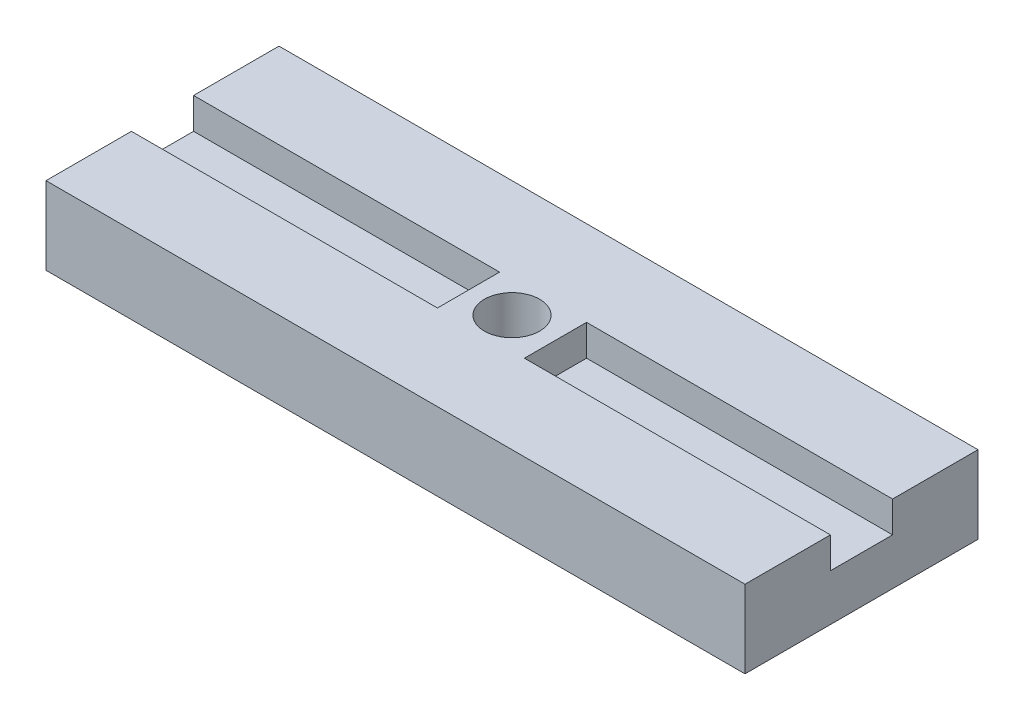
ISO-10303-21;
HEADER;
FILE_DESCRIPTION(('STEP AP214'),'2;1');
FILE_NAME('part.step','',(''),(''),'','','');
FILE_SCHEMA(('AUTOMOTIVE_DESIGN { 1 0 10303 214 1 1 1 1 }'));
ENDSEC;
DATA;
#1=APPLICATION_CONTEXT('core data for automotive mechanical design processes');
#2=APPLICATION_PROTOCOL_DEFINITION('international standard','automotive_design',2000,#1);
#3=PRODUCT_CONTEXT('',#1,'mechanical');
#4=PRODUCT('Part','Part','',(#3));
#5=PRODUCT_RELATED_PRODUCT_CATEGORY('part','',(#4));
#6=PRODUCT_DEFINITION_FORMATION('','',#4);
#7=PRODUCT_DEFINITION_CONTEXT('part definition',#1,'design');
#8=PRODUCT_DEFINITION('design','',#6,#7);
#9=PRODUCT_DEFINITION_SHAPE('','',#8);
#10=(LENGTH_UNIT() NAMED_UNIT(*) SI_UNIT(.MILLI.,.METRE.));
#11=(NAMED_UNIT(*) PLANE_ANGLE_UNIT() SI_UNIT($,.RADIAN.));
#12=(NAMED_UNIT(*) SI_UNIT($,.STERADIAN.) SOLID_ANGLE_UNIT());
#13=UNCERTAINTY_MEASURE_WITH_UNIT(LENGTH_MEASURE(1.E-05),#10,'distance_accuracy_value','');
#14=(GEOMETRIC_REPRESENTATION_CONTEXT(3) GLOBAL_UNCERTAINTY_ASSIGNED_CONTEXT((#13)) GLOBAL_UNIT_ASSIGNED_CONTEXT((#10,
#11,#12)) REPRESENTATION_CONTEXT('',''));
#15=CARTESIAN_POINT('',(0.,0.,0.));
#16=DIRECTION('',(0.,0.,1.));
#17=DIRECTION('',(1.,0.,0.));
#18=AXIS2_PLACEMENT_3D('',#15,#16,#17);
#19=CARTESIAN_POINT('',(14.2875,3.175,4.7625));
#20=DIRECTION('',(-1.,0.,0.));
#21=DIRECTION('',(0.,0.,1.));
#22=AXIS2_PLACEMENT_3D('',#19,#20,#21);
#23=PLANE('',#22);
#24=DIRECTION('',(0.,0.,-1.));
#25=VECTOR('',#24,1.);
#26=CARTESIAN_POINT('',(14.2875,1.905,1.26999999999996));
#27=LINE('',#26,#25);
#28=CARTESIAN_POINT('',(14.2875,1.905,1.26999999999996));
#29=VERTEX_POINT('',#28);
#30=CARTESIAN_POINT('',(14.2875,1.905,-1.27000000000004));
#31=VERTEX_POINT('',#30);
#32=EDGE_CURVE('E201',#29,#31,#27,.T.);
#33=ORIENTED_EDGE('',*,*,#32,.F.);
#34=DIRECTION('',(0.,1.,0.));
#35=VECTOR('',#34,1.);
#36=CARTESIAN_POINT('',(14.2875,1.905,1.26999999999996));
#37=LINE('',#36,#35);
#38=CARTESIAN_POINT('',(14.2875,3.175,1.26999999999996));
#39=VERTEX_POINT('',#38);
#40=EDGE_CURVE('E193',#29,#39,#37,.T.);
#41=ORIENTED_EDGE('',*,*,#40,.T.);
#42=DIRECTION('',(0.,0.,-1.));
#43=VECTOR('',#42,1.);
#44=CARTESIAN_POINT('',(14.2875,3.175,4.7625));
#45=LINE('',#44,#43);
#46=CARTESIAN_POINT('',(14.2875,3.175,4.7625));
#47=VERTEX_POINT('',#46);
#48=EDGE_CURVE('E229',#47,#39,#45,.T.);
#49=ORIENTED_EDGE('',*,*,#48,.F.);
#50=DIRECTION('',(0.,-1.,0.));
#51=VECTOR('',#50,1.);
#52=CARTESIAN_POINT('',(14.2875,3.175,4.7625));
#53=LINE('',#52,#51);
#54=CARTESIAN_POINT('',(14.2875,0.,4.7625));
#55=VERTEX_POINT('',#54);
#56=EDGE_CURVE('E245',#47,#55,#53,.T.);
#57=ORIENTED_EDGE('',*,*,#56,.T.);
#58=DIRECTION('',(0.,0.,-1.));
#59=VECTOR('',#58,1.);
#60=CARTESIAN_POINT('',(14.2875,0.,4.7625));
#61=LINE('',#60,#59);
#62=CARTESIAN_POINT('',(14.2875,0.,-4.7625));
#63=VERTEX_POINT('',#62);
#64=EDGE_CURVE('E228',#55,#63,#61,.T.);
#65=ORIENTED_EDGE('',*,*,#64,.T.);
#66=DIRECTION('',(0.,-1.,0.));
#67=VECTOR('',#66,1.);
#68=CARTESIAN_POINT('',(14.2875,3.175,-4.7625));
#69=LINE('',#68,#67);
#70=CARTESIAN_POINT('',(14.2875,3.175,-4.7625));
#71=VERTEX_POINT('',#70);
#72=EDGE_CURVE('E11',#71,#63,#69,.T.);
#73=ORIENTED_EDGE('',*,*,#72,.F.);
#74=CARTESIAN_POINT('',(14.2875,3.175,-1.27000000000002));
#75=VERTEX_POINT('',#74);
#76=EDGE_CURVE('E234',#75,#71,#45,.T.);
#77=ORIENTED_EDGE('',*,*,#76,.F.);
#78=DIRECTION('',(0.,1.,0.));
#79=VECTOR('',#78,1.);
#80=CARTESIAN_POINT('',(14.2875,1.905,-1.27000000000004));
#81=LINE('',#80,#79);
#82=EDGE_CURVE('E70',#31,#75,#81,.T.);
#83=ORIENTED_EDGE('',*,*,#82,.F.);
#84=EDGE_LOOP('',(#33,#41,#49,#57,#65,#73,#77,#83));
#85=FACE_BOUND('',#84,.T.);
#86=ADVANCED_FACE('F47',(#85),#23,.F.);
#87=CARTESIAN_POINT('',(-14.2875,3.175,-4.7625));
#88=DIRECTION('',(0.,0.,1.));
#89=DIRECTION('',(1.,0.,0.));
#90=AXIS2_PLACEMENT_3D('',#87,#88,#89);
#91=PLANE('',#90);
#92=DIRECTION('',(-1.,0.,0.));
#93=VECTOR('',#92,1.);
#94=CARTESIAN_POINT('',(-14.2875,0.,-4.7625));
#95=LINE('',#94,#93);
#96=CARTESIAN_POINT('',(-14.2875,0.,-4.7625));
#97=VERTEX_POINT('',#96);
#98=EDGE_CURVE('E249',#63,#97,#95,.T.);
#99=ORIENTED_EDGE('',*,*,#98,.T.);
#100=DIRECTION('',(0.,-1.,0.));
#101=VECTOR('',#100,1.);
#102=CARTESIAN_POINT('',(-14.2875,3.175,-4.7625));
#103=LINE('',#102,#101);
#104=CARTESIAN_POINT('',(-14.2875,3.175,-4.7625));
#105=VERTEX_POINT('',#104);
#106=EDGE_CURVE('E55',#105,#97,#103,.T.);
#107=ORIENTED_EDGE('',*,*,#106,.F.);
#108=DIRECTION('',(-1.,0.,0.));
#109=VECTOR('',#108,1.);
#110=CARTESIAN_POINT('',(-14.2875,3.175,-4.7625));
#111=LINE('',#110,#109);
#112=EDGE_CURVE('E233',#71,#105,#111,.T.);
#113=ORIENTED_EDGE('',*,*,#112,.F.);
#114=ORIENTED_EDGE('',*,*,#72,.T.);
#115=EDGE_LOOP('',(#99,#107,#113,#114));
#116=FACE_BOUND('',#115,.T.);
#117=ADVANCED_FACE('F296',(#116),#91,.F.);
#118=CARTESIAN_POINT('',(-14.2875,3.175,4.7625));
#119=DIRECTION('',(1.,0.,0.));
#120=DIRECTION('',(0.,0.,-1.));
#121=AXIS2_PLACEMENT_3D('',#118,#119,#120);
#122=PLANE('',#121);
#123=DIRECTION('',(0.,0.,1.));
#124=VECTOR('',#123,1.);
#125=CARTESIAN_POINT('',(-14.2875,3.175,4.7625));
#126=LINE('',#125,#124);
#127=CARTESIAN_POINT('',(-14.2875,3.175,1.27));
#128=VERTEX_POINT('',#127);
#129=CARTESIAN_POINT('',(-14.2875,3.175,4.7625));
#130=VERTEX_POINT('',#129);
#131=EDGE_CURVE('E237',#128,#130,#126,.T.);
#132=ORIENTED_EDGE('',*,*,#131,.F.);
#133=DIRECTION('',(0.,1.,0.));
#134=VECTOR('',#133,1.);
#135=CARTESIAN_POINT('',(-14.2875,1.905,1.27));
#136=LINE('',#135,#134);
#137=CARTESIAN_POINT('',(-14.2875,1.905,1.27));
#138=VERTEX_POINT('',#137);
#139=EDGE_CURVE('E179',#138,#128,#136,.T.);
#140=ORIENTED_EDGE('',*,*,#139,.F.);
#141=DIRECTION('',(0.,0.,1.));
#142=VECTOR('',#141,1.);
#143=CARTESIAN_POINT('',(-14.2875,1.905,1.27));
#144=LINE('',#143,#142);
#145=CARTESIAN_POINT('',(-14.2875,1.905,-1.27));
#146=VERTEX_POINT('',#145);
#147=EDGE_CURVE('E154',#146,#138,#144,.T.);
#148=ORIENTED_EDGE('',*,*,#147,.F.);
#149=DIRECTION('',(0.,1.,0.));
#150=VECTOR('',#149,1.);
#151=CARTESIAN_POINT('',(-14.2875,1.905,-1.27));
#152=LINE('',#151,#150);
#153=CARTESIAN_POINT('',(-14.2875,3.175,-1.27));
#154=VERTEX_POINT('',#153);
#155=EDGE_CURVE('E144',#146,#154,#152,.T.);
#156=ORIENTED_EDGE('',*,*,#155,.T.);
#157=EDGE_CURVE('E238',#105,#154,#126,.T.);
#158=ORIENTED_EDGE('',*,*,#157,.F.);
#159=ORIENTED_EDGE('',*,*,#106,.T.);
#160=DIRECTION('',(0.,0.,1.));
#161=VECTOR('',#160,1.);
#162=CARTESIAN_POINT('',(-14.2875,0.,4.7625));
#163=LINE('',#162,#161);
#164=CARTESIAN_POINT('',(-14.2875,0.,4.7625));
#165=VERTEX_POINT('',#164);
#166=EDGE_CURVE('E252',#97,#165,#163,.T.);
#167=ORIENTED_EDGE('',*,*,#166,.T.);
#168=DIRECTION('',(0.,-1.,0.));
#169=VECTOR('',#168,1.);
#170=CARTESIAN_POINT('',(-14.2875,3.175,4.7625));
#171=LINE('',#170,#169);
#172=EDGE_CURVE('E261',#130,#165,#171,.T.);
#173=ORIENTED_EDGE('',*,*,#172,.F.);
#174=EDGE_LOOP('',(#132,#140,#148,#156,#158,#159,#167,#173));
#175=FACE_BOUND('',#174,.T.);
#176=ADVANCED_FACE('F271',(#175),#122,.F.);
#177=CARTESIAN_POINT('',(-14.2875,3.175,4.7625));
#178=DIRECTION('',(0.,0.,-1.));
#179=DIRECTION('',(-1.,0.,0.));
#180=AXIS2_PLACEMENT_3D('',#177,#178,#179);
#181=PLANE('',#180);
#182=DIRECTION('',(1.,0.,0.));
#183=VECTOR('',#182,1.);
#184=CARTESIAN_POINT('',(-14.2875,0.,4.7625));
#185=LINE('',#184,#183);
#186=EDGE_CURVE('E255',#165,#55,#185,.T.);
#187=ORIENTED_EDGE('',*,*,#186,.T.);
#188=ORIENTED_EDGE('',*,*,#56,.F.);
#189=DIRECTION('',(1.,0.,0.));
#190=VECTOR('',#189,1.);
#191=CARTESIAN_POINT('',(-14.2875,3.175,4.7625));
#192=LINE('',#191,#190);
#193=EDGE_CURVE('E242',#130,#47,#192,.T.);
#194=ORIENTED_EDGE('',*,*,#193,.F.);
#195=ORIENTED_EDGE('',*,*,#172,.T.);
#196=EDGE_LOOP('',(#187,#188,#194,#195));
#197=FACE_BOUND('',#196,.T.);
#198=ADVANCED_FACE('F281',(#197),#181,.F.);
#199=CARTESIAN_POINT('',(0.,3.175,0.));
#200=DIRECTION('',(0.,-1.,0.));
#201=DIRECTION('',(0.,0.,-1.));
#202=AXIS2_PLACEMENT_3D('',#199,#200,#201);
#203=PLANE('',#202);
#204=CARTESIAN_POINT('',(0.,3.175,0.));
#205=DIRECTION('',(0.,1.,0.));
#206=DIRECTION('',(0.,0.,1.));
#207=AXIS2_PLACEMENT_3D('',#204,#205,#206);
#208=CIRCLE('',#207,1.1303);
#209=CARTESIAN_POINT('',(0.,3.175,1.1303));
#210=VERTEX_POINT('',#209);
#211=EDGE_CURVE('E178',#210,#210,#208,.T.);
#212=ORIENTED_EDGE('',*,*,#211,.F.);
#213=EDGE_LOOP('',(#212));
#214=FACE_BOUND('',#213,.T.);
#215=DIRECTION('',(0.,0.,-1.));
#216=VECTOR('',#215,1.);
#217=CARTESIAN_POINT('',(-1.778,3.175,1.27));
#218=LINE('',#217,#216);
#219=CARTESIAN_POINT('',(-1.778,3.175,1.27));
#220=VERTEX_POINT('',#219);
#221=CARTESIAN_POINT('',(-1.778,3.175,-1.27));
#222=VERTEX_POINT('',#221);
#223=EDGE_CURVE('E62',#220,#222,#218,.T.);
#224=ORIENTED_EDGE('',*,*,#223,.F.);
#225=DIRECTION('',(1.,0.,0.));
#226=VECTOR('',#225,1.);
#227=CARTESIAN_POINT('',(-14.2875,3.175,1.27));
#228=LINE('',#227,#226);
#229=EDGE_CURVE('E159',#128,#220,#228,.T.);
#230=ORIENTED_EDGE('',*,*,#229,.F.);
#231=ORIENTED_EDGE('',*,*,#131,.T.);
#232=ORIENTED_EDGE('',*,*,#193,.T.);
#233=ORIENTED_EDGE('',*,*,#48,.T.);
#234=DIRECTION('',(1.,0.,0.));
#235=VECTOR('',#234,1.);
#236=CARTESIAN_POINT('',(14.2875,3.175,1.26999999999996));
#237=LINE('',#236,#235);
#238=CARTESIAN_POINT('',(1.778,3.175,1.27));
#239=VERTEX_POINT('',#238);
#240=EDGE_CURVE('E197',#239,#39,#237,.T.);
#241=ORIENTED_EDGE('',*,*,#240,.F.);
#242=DIRECTION('',(0.,0.,1.));
#243=VECTOR('',#242,1.);
#244=CARTESIAN_POINT('',(1.778,3.175,1.27));
#245=LINE('',#244,#243);
#246=CARTESIAN_POINT('',(1.778,3.175,-1.27000000000001));
#247=VERTEX_POINT('',#246);
#248=EDGE_CURVE('E200',#247,#239,#245,.T.);
#249=ORIENTED_EDGE('',*,*,#248,.F.);
#250=DIRECTION('',(-1.,0.,0.));
#251=VECTOR('',#250,1.);
#252=CARTESIAN_POINT('',(14.2875,3.175,-1.27000000000004));
#253=LINE('',#252,#251);
#254=EDGE_CURVE('E172',#75,#247,#253,.T.);
#255=ORIENTED_EDGE('',*,*,#254,.F.);
#256=ORIENTED_EDGE('',*,*,#76,.T.);
#257=ORIENTED_EDGE('',*,*,#112,.T.);
#258=ORIENTED_EDGE('',*,*,#157,.T.);
#259=DIRECTION('',(-1.,0.,0.));
#260=VECTOR('',#259,1.);
#261=CARTESIAN_POINT('',(-14.2875,3.175,-1.27));
#262=LINE('',#261,#260);
#263=EDGE_CURVE('E163',#222,#154,#262,.T.);
#264=ORIENTED_EDGE('',*,*,#263,.F.);
#265=EDGE_LOOP('',(#224,#230,#231,#232,#233,#241,#249,#255,#256,#257,#258,#264));
#266=FACE_BOUND('',#265,.T.);
#267=ADVANCED_FACE('F289',(#214,#266),#203,.F.);
#268=CARTESIAN_POINT('',(0.,0.,0.));
#269=DIRECTION('',(0.,-1.,0.));
#270=DIRECTION('',(0.,0.,-1.));
#271=AXIS2_PLACEMENT_3D('',#268,#269,#270);
#272=PLANE('',#271);
#273=CARTESIAN_POINT('',(0.,0.,0.));
#274=DIRECTION('',(0.,-1.,0.));
#275=DIRECTION('',(0.,0.,-1.));
#276=AXIS2_PLACEMENT_3D('',#273,#274,#275);
#277=CIRCLE('',#276,1.1303);
#278=CARTESIAN_POINT('',(0.,0.,-1.1303));
#279=VERTEX_POINT('',#278);
#280=EDGE_CURVE('E224',#279,#279,#277,.T.);
#281=ORIENTED_EDGE('',*,*,#280,.F.);
#282=EDGE_LOOP('',(#281));
#283=FACE_BOUND('',#282,.T.);
#284=ORIENTED_EDGE('',*,*,#64,.F.);
#285=ORIENTED_EDGE('',*,*,#186,.F.);
#286=ORIENTED_EDGE('',*,*,#166,.F.);
#287=ORIENTED_EDGE('',*,*,#98,.F.);
#288=EDGE_LOOP('',(#284,#285,#286,#287));
#289=FACE_BOUND('',#288,.T.);
#290=ADVANCED_FACE('F278',(#283,#289),#272,.T.);
#291=CARTESIAN_POINT('',(0.,3.175,0.));
#292=DIRECTION('',(0.,1.,0.));
#293=DIRECTION('',(0.,0.,1.));
#294=AXIS2_PLACEMENT_3D('',#291,#292,#293);
#295=CYLINDRICAL_SURFACE('',#294,1.1303);
#296=ORIENTED_EDGE('',*,*,#280,.T.);
#297=EDGE_LOOP('',(#296));
#298=FACE_BOUND('',#297,.T.);
#299=ORIENTED_EDGE('',*,*,#211,.T.);
#300=EDGE_LOOP('',(#299));
#301=FACE_BOUND('',#300,.T.);
#302=ADVANCED_FACE('F308',(#298,#301),#295,.F.);
#303=CARTESIAN_POINT('',(14.2875,1.905,1.26999999999996));
#304=DIRECTION('',(0.,0.,1.));
#305=DIRECTION('',(1.,0.,0.));
#306=AXIS2_PLACEMENT_3D('',#303,#304,#305);
#307=PLANE('',#306);
#308=ORIENTED_EDGE('',*,*,#240,.T.);
#309=ORIENTED_EDGE('',*,*,#40,.F.);
#310=DIRECTION('',(1.,0.,0.));
#311=VECTOR('',#310,1.);
#312=CARTESIAN_POINT('',(14.2875,1.905,1.26999999999996));
#313=LINE('',#312,#311);
#314=CARTESIAN_POINT('',(1.778,1.905,1.27));
#315=VERTEX_POINT('',#314);
#316=EDGE_CURVE('E186',#315,#29,#313,.T.);
#317=ORIENTED_EDGE('',*,*,#316,.F.);
#318=DIRECTION('',(0.,1.,0.));
#319=VECTOR('',#318,1.);
#320=CARTESIAN_POINT('',(1.778,1.905,1.27));
#321=LINE('',#320,#319);
#322=EDGE_CURVE('E190',#315,#239,#321,.T.);
#323=ORIENTED_EDGE('',*,*,#322,.T.);
#324=EDGE_LOOP('',(#308,#309,#317,#323));
#325=FACE_BOUND('',#324,.T.);
#326=ADVANCED_FACE('F315',(#325),#307,.F.);
#327=CARTESIAN_POINT('',(1.778,1.905,1.27));
#328=DIRECTION('',(-1.,0.,0.));
#329=DIRECTION('',(0.,0.,1.));
#330=AXIS2_PLACEMENT_3D('',#327,#328,#329);
#331=PLANE('',#330);
#332=ORIENTED_EDGE('',*,*,#248,.T.);
#333=ORIENTED_EDGE('',*,*,#322,.F.);
#334=DIRECTION('',(0.,0.,1.));
#335=VECTOR('',#334,1.);
#336=CARTESIAN_POINT('',(1.778,1.905,1.27));
#337=LINE('',#336,#335);
#338=CARTESIAN_POINT('',(1.778,1.905,-1.27000000000001));
#339=VERTEX_POINT('',#338);
#340=EDGE_CURVE('E210',#339,#315,#337,.T.);
#341=ORIENTED_EDGE('',*,*,#340,.F.);
#342=DIRECTION('',(0.,1.,0.));
#343=VECTOR('',#342,1.);
#344=CARTESIAN_POINT('',(1.778,1.905,-1.27000000000001));
#345=LINE('',#344,#343);
#346=EDGE_CURVE('E187',#339,#247,#345,.T.);
#347=ORIENTED_EDGE('',*,*,#346,.T.);
#348=EDGE_LOOP('',(#332,#333,#341,#347));
#349=FACE_BOUND('',#348,.T.);
#350=ADVANCED_FACE('F324',(#349),#331,.F.);
#351=CARTESIAN_POINT('',(14.2875,1.905,-1.27000000000004));
#352=DIRECTION('',(0.,0.,-1.));
#353=DIRECTION('',(-1.,0.,0.));
#354=AXIS2_PLACEMENT_3D('',#351,#352,#353);
#355=PLANE('',#354);
#356=ORIENTED_EDGE('',*,*,#254,.T.);
#357=ORIENTED_EDGE('',*,*,#346,.F.);
#358=DIRECTION('',(-1.,0.,0.));
#359=VECTOR('',#358,1.);
#360=CARTESIAN_POINT('',(14.2875,1.905,-1.27000000000004));
#361=LINE('',#360,#359);
#362=EDGE_CURVE('E214',#31,#339,#361,.T.);
#363=ORIENTED_EDGE('',*,*,#362,.F.);
#364=ORIENTED_EDGE('',*,*,#82,.T.);
#365=EDGE_LOOP('',(#356,#357,#363,#364));
#366=FACE_BOUND('',#365,.T.);
#367=ADVANCED_FACE('F320',(#366),#355,.F.);
#368=CARTESIAN_POINT('',(0.,1.905,0.));
#369=DIRECTION('',(0.,1.,0.));
#370=DIRECTION('',(0.,0.,1.));
#371=AXIS2_PLACEMENT_3D('',#368,#369,#370);
#372=PLANE('',#371);
#373=ORIENTED_EDGE('',*,*,#32,.T.);
#374=ORIENTED_EDGE('',*,*,#362,.T.);
#375=ORIENTED_EDGE('',*,*,#340,.T.);
#376=ORIENTED_EDGE('',*,*,#316,.T.);
#377=EDGE_LOOP('',(#373,#374,#375,#376));
#378=FACE_BOUND('',#377,.T.);
#379=ADVANCED_FACE('F317',(#378),#372,.T.);
#380=CARTESIAN_POINT('',(-1.778,1.905,1.27));
#381=DIRECTION('',(1.,0.,0.));
#382=DIRECTION('',(0.,0.,-1.));
#383=AXIS2_PLACEMENT_3D('',#380,#381,#382);
#384=PLANE('',#383);
#385=ORIENTED_EDGE('',*,*,#223,.T.);
#386=DIRECTION('',(0.,1.,0.));
#387=VECTOR('',#386,1.);
#388=CARTESIAN_POINT('',(-1.778,1.905,-1.27));
#389=LINE('',#388,#387);
#390=CARTESIAN_POINT('',(-1.778,1.905,-1.27));
#391=VERTEX_POINT('',#390);
#392=EDGE_CURVE('E135',#391,#222,#389,.T.);
#393=ORIENTED_EDGE('',*,*,#392,.F.);
#394=DIRECTION('',(0.,0.,-1.));
#395=VECTOR('',#394,1.);
#396=CARTESIAN_POINT('',(-1.778,1.905,1.27));
#397=LINE('',#396,#395);
#398=CARTESIAN_POINT('',(-1.778,1.905,1.27));
#399=VERTEX_POINT('',#398);
#400=EDGE_CURVE('E139',#399,#391,#397,.T.);
#401=ORIENTED_EDGE('',*,*,#400,.F.);
#402=DIRECTION('',(0.,1.,0.));
#403=VECTOR('',#402,1.);
#404=CARTESIAN_POINT('',(-1.778,1.905,1.27));
#405=LINE('',#404,#403);
#406=EDGE_CURVE('E175',#399,#220,#405,.T.);
#407=ORIENTED_EDGE('',*,*,#406,.T.);
#408=EDGE_LOOP('',(#385,#393,#401,#407));
#409=FACE_BOUND('',#408,.T.);
#410=ADVANCED_FACE('F137',(#409),#384,.F.);
#411=CARTESIAN_POINT('',(-14.2875,1.905,1.27));
#412=DIRECTION('',(0.,0.,1.));
#413=DIRECTION('',(1.,0.,0.));
#414=AXIS2_PLACEMENT_3D('',#411,#412,#413);
#415=PLANE('',#414);
#416=ORIENTED_EDGE('',*,*,#229,.T.);
#417=ORIENTED_EDGE('',*,*,#406,.F.);
#418=DIRECTION('',(1.,0.,0.));
#419=VECTOR('',#418,1.);
#420=CARTESIAN_POINT('',(-14.2875,1.905,1.27));
#421=LINE('',#420,#419);
#422=EDGE_CURVE('E145',#138,#399,#421,.T.);
#423=ORIENTED_EDGE('',*,*,#422,.F.);
#424=ORIENTED_EDGE('',*,*,#139,.T.);
#425=EDGE_LOOP('',(#416,#417,#423,#424));
#426=FACE_BOUND('',#425,.T.);
#427=ADVANCED_FACE('F333',(#426),#415,.F.);
#428=CARTESIAN_POINT('',(-14.2875,1.905,-1.27));
#429=DIRECTION('',(0.,0.,-1.));
#430=DIRECTION('',(-1.,0.,0.));
#431=AXIS2_PLACEMENT_3D('',#428,#429,#430);
#432=PLANE('',#431);
#433=ORIENTED_EDGE('',*,*,#263,.T.);
#434=ORIENTED_EDGE('',*,*,#155,.F.);
#435=DIRECTION('',(-1.,0.,0.));
#436=VECTOR('',#435,1.);
#437=CARTESIAN_POINT('',(-14.2875,1.905,-1.27));
#438=LINE('',#437,#436);
#439=EDGE_CURVE('E148',#391,#146,#438,.T.);
#440=ORIENTED_EDGE('',*,*,#439,.F.);
#441=ORIENTED_EDGE('',*,*,#392,.T.);
#442=EDGE_LOOP('',(#433,#434,#440,#441));
#443=FACE_BOUND('',#442,.T.);
#444=ADVANCED_FACE('F149',(#443),#432,.F.);
#445=CARTESIAN_POINT('',(0.,1.905,0.));
#446=DIRECTION('',(0.,-1.,0.));
#447=DIRECTION('',(0.,0.,-1.));
#448=AXIS2_PLACEMENT_3D('',#445,#446,#447);
#449=PLANE('',#448);
#450=ORIENTED_EDGE('',*,*,#400,.T.);
#451=ORIENTED_EDGE('',*,*,#439,.T.);
#452=ORIENTED_EDGE('',*,*,#147,.T.);
#453=ORIENTED_EDGE('',*,*,#422,.T.);
#454=EDGE_LOOP('',(#450,#451,#452,#453));
#455=FACE_BOUND('',#454,.T.);
#456=ADVANCED_FACE('F156',(#455),#449,.F.);
#457=CLOSED_SHELL('',(#86,#117,#176,#198,#267,#290,#302,#326,#350,#367,#379,#410,#427,#444,#456));
#458=MANIFOLD_SOLID_BREP('B2',#457);
#459=ADVANCED_BREP_SHAPE_REPRESENTATION('',(#18,#458),#14);
#460=SHAPE_DEFINITION_REPRESENTATION(#9,#459);
ENDSEC;
END-ISO-10303-21;
